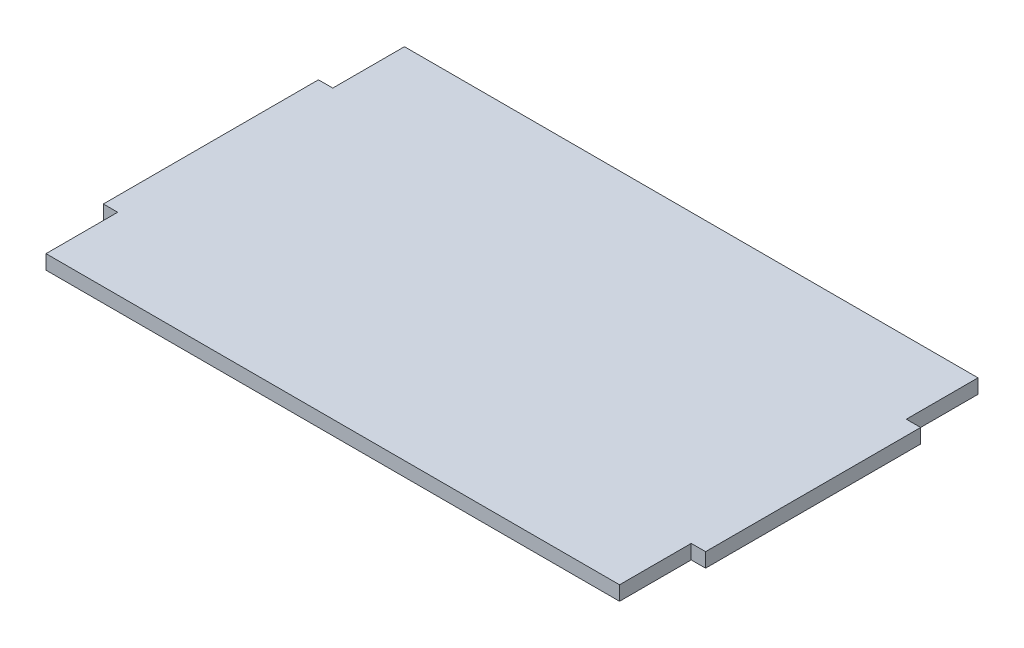
ISO-10303-21;
HEADER;
FILE_DESCRIPTION(('STEP AP214'),'2;1');
FILE_NAME('part.step','',(''),(''),'','','');
FILE_SCHEMA(('AUTOMOTIVE_DESIGN { 1 0 10303 214 1 1 1 1 }'));
ENDSEC;
DATA;
#1=APPLICATION_CONTEXT('core data for automotive mechanical design processes');
#2=APPLICATION_PROTOCOL_DEFINITION('international standard','automotive_design',2000,#1);
#3=PRODUCT_CONTEXT('',#1,'mechanical');
#4=PRODUCT('Part','Part','',(#3));
#5=PRODUCT_RELATED_PRODUCT_CATEGORY('part','',(#4));
#6=PRODUCT_DEFINITION_FORMATION('','',#4);
#7=PRODUCT_DEFINITION_CONTEXT('part definition',#1,'design');
#8=PRODUCT_DEFINITION('design','',#6,#7);
#9=PRODUCT_DEFINITION_SHAPE('','',#8);
#10=(LENGTH_UNIT() NAMED_UNIT(*) SI_UNIT(.MILLI.,.METRE.));
#11=(NAMED_UNIT(*) PLANE_ANGLE_UNIT() SI_UNIT($,.RADIAN.));
#12=(NAMED_UNIT(*) SI_UNIT($,.STERADIAN.) SOLID_ANGLE_UNIT());
#13=UNCERTAINTY_MEASURE_WITH_UNIT(LENGTH_MEASURE(1.E-05),#10,'distance_accuracy_value','');
#14=(GEOMETRIC_REPRESENTATION_CONTEXT(3) GLOBAL_UNCERTAINTY_ASSIGNED_CONTEXT((#13)) GLOBAL_UNIT_ASSIGNED_CONTEXT((#10,
#11,#12)) REPRESENTATION_CONTEXT('',''));
#15=CARTESIAN_POINT('',(0.,0.,0.));
#16=DIRECTION('',(0.,0.,1.));
#17=DIRECTION('',(1.,0.,0.));
#18=AXIS2_PLACEMENT_3D('',#15,#16,#17);
#19=CARTESIAN_POINT('',(0.,4.,0.));
#20=DIRECTION('',(1.,0.,0.));
#21=DIRECTION('',(0.,0.,-1.));
#22=AXIS2_PLACEMENT_3D('',#19,#20,#21);
#23=PLANE('',#22);
#24=DIRECTION('',(0.,0.,1.));
#25=VECTOR('',#24,1.);
#26=CARTESIAN_POINT('',(0.,0.,0.));
#27=LINE('',#26,#25);
#28=CARTESIAN_POINT('',(0.,0.,0.));
#29=VERTEX_POINT('',#28);
#30=CARTESIAN_POINT('',(0.,0.,20.));
#31=VERTEX_POINT('',#30);
#32=EDGE_CURVE('E172',#29,#31,#27,.T.);
#33=ORIENTED_EDGE('',*,*,#32,.T.);
#34=DIRECTION('',(0.,-1.,0.));
#35=VECTOR('',#34,1.);
#36=CARTESIAN_POINT('',(0.,4.,20.));
#37=LINE('',#36,#35);
#38=CARTESIAN_POINT('',(0.,4.,20.));
#39=VERTEX_POINT('',#38);
#40=EDGE_CURVE('E11',#39,#31,#37,.T.);
#41=ORIENTED_EDGE('',*,*,#40,.F.);
#42=DIRECTION('',(0.,0.,1.));
#43=VECTOR('',#42,1.);
#44=CARTESIAN_POINT('',(0.,4.,0.));
#45=LINE('',#44,#43);
#46=CARTESIAN_POINT('',(0.,4.,0.));
#47=VERTEX_POINT('',#46);
#48=EDGE_CURVE('E206',#47,#39,#45,.T.);
#49=ORIENTED_EDGE('',*,*,#48,.F.);
#50=DIRECTION('',(0.,-1.,0.));
#51=VECTOR('',#50,1.);
#52=CARTESIAN_POINT('',(0.,4.,0.));
#53=LINE('',#52,#51);
#54=EDGE_CURVE('E168',#47,#29,#53,.T.);
#55=ORIENTED_EDGE('',*,*,#54,.T.);
#56=EDGE_LOOP('',(#33,#41,#49,#55));
#57=FACE_BOUND('',#56,.T.);
#58=ADVANCED_FACE('F47',(#57),#23,.F.);
#59=CARTESIAN_POINT('',(0.,4.,20.));
#60=DIRECTION('',(0.,0.,1.));
#61=DIRECTION('',(1.,0.,0.));
#62=AXIS2_PLACEMENT_3D('',#59,#60,#61);
#63=PLANE('',#62);
#64=DIRECTION('',(-1.,0.,0.));
#65=VECTOR('',#64,1.);
#66=CARTESIAN_POINT('',(0.,0.,20.));
#67=LINE('',#66,#65);
#68=CARTESIAN_POINT('',(-4.,0.,20.));
#69=VERTEX_POINT('',#68);
#70=EDGE_CURVE('E176',#31,#69,#67,.T.);
#71=ORIENTED_EDGE('',*,*,#70,.T.);
#72=DIRECTION('',(0.,-1.,0.));
#73=VECTOR('',#72,1.);
#74=CARTESIAN_POINT('',(-4.,4.,20.));
#75=LINE('',#74,#73);
#76=CARTESIAN_POINT('',(-4.,4.,20.));
#77=VERTEX_POINT('',#76);
#78=EDGE_CURVE('E56',#77,#69,#75,.T.);
#79=ORIENTED_EDGE('',*,*,#78,.F.);
#80=DIRECTION('',(-1.,0.,0.));
#81=VECTOR('',#80,1.);
#82=CARTESIAN_POINT('',(0.,4.,20.));
#83=LINE('',#82,#81);
#84=EDGE_CURVE('E119',#39,#77,#83,.T.);
#85=ORIENTED_EDGE('',*,*,#84,.F.);
#86=ORIENTED_EDGE('',*,*,#40,.T.);
#87=EDGE_LOOP('',(#71,#79,#85,#86));
#88=FACE_BOUND('',#87,.T.);
#89=ADVANCED_FACE('F300',(#88),#63,.F.);
#90=CARTESIAN_POINT('',(-4.,4.,80.));
#91=DIRECTION('',(1.,0.,0.));
#92=DIRECTION('',(0.,0.,-1.));
#93=AXIS2_PLACEMENT_3D('',#90,#91,#92);
#94=PLANE('',#93);
#95=DIRECTION('',(0.,0.,1.));
#96=VECTOR('',#95,1.);
#97=CARTESIAN_POINT('',(-4.,0.,80.));
#98=LINE('',#97,#96);
#99=CARTESIAN_POINT('',(-4.,0.,80.));
#100=VERTEX_POINT('',#99);
#101=EDGE_CURVE('E179',#69,#100,#98,.T.);
#102=ORIENTED_EDGE('',*,*,#101,.T.);
#103=DIRECTION('',(0.,-1.,0.));
#104=VECTOR('',#103,1.);
#105=CARTESIAN_POINT('',(-4.,4.,80.));
#106=LINE('',#105,#104);
#107=CARTESIAN_POINT('',(-4.,4.,80.));
#108=VERTEX_POINT('',#107);
#109=EDGE_CURVE('E233',#108,#100,#106,.T.);
#110=ORIENTED_EDGE('',*,*,#109,.F.);
#111=DIRECTION('',(0.,0.,1.));
#112=VECTOR('',#111,1.);
#113=CARTESIAN_POINT('',(-4.,4.,80.));
#114=LINE('',#113,#112);
#115=EDGE_CURVE('E243',#77,#108,#114,.T.);
#116=ORIENTED_EDGE('',*,*,#115,.F.);
#117=ORIENTED_EDGE('',*,*,#78,.T.);
#118=EDGE_LOOP('',(#102,#110,#116,#117));
#119=FACE_BOUND('',#118,.T.);
#120=ADVANCED_FACE('F241',(#119),#94,.F.);
#121=CARTESIAN_POINT('',(0.,4.,80.));
#122=DIRECTION('',(0.,0.,-1.));
#123=DIRECTION('',(-1.,0.,0.));
#124=AXIS2_PLACEMENT_3D('',#121,#122,#123);
#125=PLANE('',#124);
#126=DIRECTION('',(1.,0.,0.));
#127=VECTOR('',#126,1.);
#128=CARTESIAN_POINT('',(0.,0.,80.));
#129=LINE('',#128,#127);
#130=CARTESIAN_POINT('',(0.,0.,80.));
#131=VERTEX_POINT('',#130);
#132=EDGE_CURVE('E182',#100,#131,#129,.T.);
#133=ORIENTED_EDGE('',*,*,#132,.T.);
#134=DIRECTION('',(0.,-1.,0.));
#135=VECTOR('',#134,1.);
#136=CARTESIAN_POINT('',(0.,4.,80.));
#137=LINE('',#136,#135);
#138=CARTESIAN_POINT('',(0.,4.,80.));
#139=VERTEX_POINT('',#138);
#140=EDGE_CURVE('E229',#139,#131,#137,.T.);
#141=ORIENTED_EDGE('',*,*,#140,.F.);
#142=DIRECTION('',(1.,0.,0.));
#143=VECTOR('',#142,1.);
#144=CARTESIAN_POINT('',(0.,4.,80.));
#145=LINE('',#144,#143);
#146=EDGE_CURVE('E262',#108,#139,#145,.T.);
#147=ORIENTED_EDGE('',*,*,#146,.F.);
#148=ORIENTED_EDGE('',*,*,#109,.T.);
#149=EDGE_LOOP('',(#133,#141,#147,#148));
#150=FACE_BOUND('',#149,.T.);
#151=ADVANCED_FACE('F252',(#150),#125,.F.);
#152=CARTESIAN_POINT('',(0.,4.,80.));
#153=DIRECTION('',(1.,0.,0.));
#154=DIRECTION('',(0.,0.,-1.));
#155=AXIS2_PLACEMENT_3D('',#152,#153,#154);
#156=PLANE('',#155);
#157=DIRECTION('',(0.,0.,1.));
#158=VECTOR('',#157,1.);
#159=CARTESIAN_POINT('',(0.,0.,80.));
#160=LINE('',#159,#158);
#161=CARTESIAN_POINT('',(0.,0.,100.));
#162=VERTEX_POINT('',#161);
#163=EDGE_CURVE('E185',#131,#162,#160,.T.);
#164=ORIENTED_EDGE('',*,*,#163,.T.);
#165=DIRECTION('',(0.,-1.,0.));
#166=VECTOR('',#165,1.);
#167=CARTESIAN_POINT('',(0.,4.,100.));
#168=LINE('',#167,#166);
#169=CARTESIAN_POINT('',(0.,4.,100.));
#170=VERTEX_POINT('',#169);
#171=EDGE_CURVE('E225',#170,#162,#168,.T.);
#172=ORIENTED_EDGE('',*,*,#171,.F.);
#173=DIRECTION('',(0.,0.,1.));
#174=VECTOR('',#173,1.);
#175=CARTESIAN_POINT('',(0.,4.,80.));
#176=LINE('',#175,#174);
#177=EDGE_CURVE('E258',#139,#170,#176,.T.);
#178=ORIENTED_EDGE('',*,*,#177,.F.);
#179=ORIENTED_EDGE('',*,*,#140,.T.);
#180=EDGE_LOOP('',(#164,#172,#178,#179));
#181=FACE_BOUND('',#180,.T.);
#182=ADVANCED_FACE('F256',(#181),#156,.F.);
#183=CARTESIAN_POINT('',(0.,4.,100.));
#184=DIRECTION('',(0.,0.,-1.));
#185=DIRECTION('',(-1.,0.,0.));
#186=AXIS2_PLACEMENT_3D('',#183,#184,#185);
#187=PLANE('',#186);
#188=DIRECTION('',(1.,0.,0.));
#189=VECTOR('',#188,1.);
#190=CARTESIAN_POINT('',(0.,0.,100.));
#191=LINE('',#190,#189);
#192=CARTESIAN_POINT('',(160.,0.,100.));
#193=VERTEX_POINT('',#192);
#194=EDGE_CURVE('E188',#162,#193,#191,.T.);
#195=ORIENTED_EDGE('',*,*,#194,.T.);
#196=DIRECTION('',(0.,-1.,0.));
#197=VECTOR('',#196,1.);
#198=CARTESIAN_POINT('',(160.,4.,100.));
#199=LINE('',#198,#197);
#200=CARTESIAN_POINT('',(160.,4.,100.));
#201=VERTEX_POINT('',#200);
#202=EDGE_CURVE('E221',#201,#193,#199,.T.);
#203=ORIENTED_EDGE('',*,*,#202,.F.);
#204=DIRECTION('',(1.,0.,0.));
#205=VECTOR('',#204,1.);
#206=CARTESIAN_POINT('',(0.,4.,100.));
#207=LINE('',#206,#205);
#208=EDGE_CURVE('E261',#170,#201,#207,.T.);
#209=ORIENTED_EDGE('',*,*,#208,.F.);
#210=ORIENTED_EDGE('',*,*,#171,.T.);
#211=EDGE_LOOP('',(#195,#203,#209,#210));
#212=FACE_BOUND('',#211,.T.);
#213=ADVANCED_FACE('F313',(#212),#187,.F.);
#214=CARTESIAN_POINT('',(160.,4.,80.));
#215=DIRECTION('',(-1.,0.,0.));
#216=DIRECTION('',(0.,0.,1.));
#217=AXIS2_PLACEMENT_3D('',#214,#215,#216);
#218=PLANE('',#217);
#219=DIRECTION('',(0.,0.,-1.));
#220=VECTOR('',#219,1.);
#221=CARTESIAN_POINT('',(160.,0.,80.));
#222=LINE('',#221,#220);
#223=CARTESIAN_POINT('',(160.,0.,80.));
#224=VERTEX_POINT('',#223);
#225=EDGE_CURVE('E191',#193,#224,#222,.T.);
#226=ORIENTED_EDGE('',*,*,#225,.T.);
#227=DIRECTION('',(0.,-1.,0.));
#228=VECTOR('',#227,1.);
#229=CARTESIAN_POINT('',(160.,4.,80.));
#230=LINE('',#229,#228);
#231=CARTESIAN_POINT('',(160.,4.,80.));
#232=VERTEX_POINT('',#231);
#233=EDGE_CURVE('E217',#232,#224,#230,.T.);
#234=ORIENTED_EDGE('',*,*,#233,.F.);
#235=DIRECTION('',(0.,0.,-1.));
#236=VECTOR('',#235,1.);
#237=CARTESIAN_POINT('',(160.,4.,80.));
#238=LINE('',#237,#236);
#239=EDGE_CURVE('E266',#201,#232,#238,.T.);
#240=ORIENTED_EDGE('',*,*,#239,.F.);
#241=ORIENTED_EDGE('',*,*,#202,.T.);
#242=EDGE_LOOP('',(#226,#234,#240,#241));
#243=FACE_BOUND('',#242,.T.);
#244=ADVANCED_FACE('F316',(#243),#218,.F.);
#245=CARTESIAN_POINT('',(160.,4.,80.));
#246=DIRECTION('',(0.,0.,-1.));
#247=DIRECTION('',(-1.,0.,0.));
#248=AXIS2_PLACEMENT_3D('',#245,#246,#247);
#249=PLANE('',#248);
#250=DIRECTION('',(1.,0.,0.));
#251=VECTOR('',#250,1.);
#252=CARTESIAN_POINT('',(160.,0.,80.));
#253=LINE('',#252,#251);
#254=CARTESIAN_POINT('',(164.,0.,80.));
#255=VERTEX_POINT('',#254);
#256=EDGE_CURVE('E194',#224,#255,#253,.T.);
#257=ORIENTED_EDGE('',*,*,#256,.T.);
#258=DIRECTION('',(0.,-1.,0.));
#259=VECTOR('',#258,1.);
#260=CARTESIAN_POINT('',(164.,4.,80.));
#261=LINE('',#260,#259);
#262=CARTESIAN_POINT('',(164.,4.,80.));
#263=VERTEX_POINT('',#262);
#264=EDGE_CURVE('E213',#263,#255,#261,.T.);
#265=ORIENTED_EDGE('',*,*,#264,.F.);
#266=DIRECTION('',(1.,0.,0.));
#267=VECTOR('',#266,1.);
#268=CARTESIAN_POINT('',(160.,4.,80.));
#269=LINE('',#268,#267);
#270=EDGE_CURVE('E273',#232,#263,#269,.T.);
#271=ORIENTED_EDGE('',*,*,#270,.F.);
#272=ORIENTED_EDGE('',*,*,#233,.T.);
#273=EDGE_LOOP('',(#257,#265,#271,#272));
#274=FACE_BOUND('',#273,.T.);
#275=ADVANCED_FACE('F281',(#274),#249,.F.);
#276=CARTESIAN_POINT('',(164.,4.,80.));
#277=DIRECTION('',(-1.,0.,0.));
#278=DIRECTION('',(0.,0.,1.));
#279=AXIS2_PLACEMENT_3D('',#276,#277,#278);
#280=PLANE('',#279);
#281=DIRECTION('',(0.,0.,-1.));
#282=VECTOR('',#281,1.);
#283=CARTESIAN_POINT('',(164.,0.,80.));
#284=LINE('',#283,#282);
#285=CARTESIAN_POINT('',(164.,0.,20.));
#286=VERTEX_POINT('',#285);
#287=EDGE_CURVE('E197',#255,#286,#284,.T.);
#288=ORIENTED_EDGE('',*,*,#287,.T.);
#289=DIRECTION('',(0.,-1.,0.));
#290=VECTOR('',#289,1.);
#291=CARTESIAN_POINT('',(164.,4.,20.));
#292=LINE('',#291,#290);
#293=CARTESIAN_POINT('',(164.,4.,20.));
#294=VERTEX_POINT('',#293);
#295=EDGE_CURVE('E161',#294,#286,#292,.T.);
#296=ORIENTED_EDGE('',*,*,#295,.F.);
#297=DIRECTION('',(0.,0.,-1.));
#298=VECTOR('',#297,1.);
#299=CARTESIAN_POINT('',(164.,4.,80.));
#300=LINE('',#299,#298);
#301=EDGE_CURVE('E150',#263,#294,#300,.T.);
#302=ORIENTED_EDGE('',*,*,#301,.F.);
#303=ORIENTED_EDGE('',*,*,#264,.T.);
#304=EDGE_LOOP('',(#288,#296,#302,#303));
#305=FACE_BOUND('',#304,.T.);
#306=ADVANCED_FACE('F285',(#305),#280,.F.);
#307=CARTESIAN_POINT('',(160.,4.,20.));
#308=DIRECTION('',(0.,0.,1.));
#309=DIRECTION('',(1.,0.,0.));
#310=AXIS2_PLACEMENT_3D('',#307,#308,#309);
#311=PLANE('',#310);
#312=DIRECTION('',(-1.,0.,0.));
#313=VECTOR('',#312,1.);
#314=CARTESIAN_POINT('',(160.,0.,20.));
#315=LINE('',#314,#313);
#316=CARTESIAN_POINT('',(160.,0.,20.));
#317=VERTEX_POINT('',#316);
#318=EDGE_CURVE('E159',#286,#317,#315,.T.);
#319=ORIENTED_EDGE('',*,*,#318,.T.);
#320=DIRECTION('',(0.,-1.,0.));
#321=VECTOR('',#320,1.);
#322=CARTESIAN_POINT('',(160.,4.,20.));
#323=LINE('',#322,#321);
#324=CARTESIAN_POINT('',(160.,4.,20.));
#325=VERTEX_POINT('',#324);
#326=EDGE_CURVE('E156',#325,#317,#323,.T.);
#327=ORIENTED_EDGE('',*,*,#326,.F.);
#328=DIRECTION('',(-1.,0.,0.));
#329=VECTOR('',#328,1.);
#330=CARTESIAN_POINT('',(160.,4.,20.));
#331=LINE('',#330,#329);
#332=EDGE_CURVE('E144',#294,#325,#331,.T.);
#333=ORIENTED_EDGE('',*,*,#332,.F.);
#334=ORIENTED_EDGE('',*,*,#295,.T.);
#335=EDGE_LOOP('',(#319,#327,#333,#334));
#336=FACE_BOUND('',#335,.T.);
#337=ADVANCED_FACE('F157',(#336),#311,.F.);
#338=CARTESIAN_POINT('',(160.,4.,0.));
#339=DIRECTION('',(-1.,0.,0.));
#340=DIRECTION('',(0.,0.,1.));
#341=AXIS2_PLACEMENT_3D('',#338,#339,#340);
#342=PLANE('',#341);
#343=DIRECTION('',(0.,0.,-1.));
#344=VECTOR('',#343,1.);
#345=CARTESIAN_POINT('',(160.,0.,0.));
#346=LINE('',#345,#344);
#347=CARTESIAN_POINT('',(160.,0.,0.));
#348=VERTEX_POINT('',#347);
#349=EDGE_CURVE('E105',#317,#348,#346,.T.);
#350=ORIENTED_EDGE('',*,*,#349,.T.);
#351=DIRECTION('',(0.,-1.,0.));
#352=VECTOR('',#351,1.);
#353=CARTESIAN_POINT('',(160.,4.,0.));
#354=LINE('',#353,#352);
#355=CARTESIAN_POINT('',(160.,4.,0.));
#356=VERTEX_POINT('',#355);
#357=EDGE_CURVE('E162',#356,#348,#354,.T.);
#358=ORIENTED_EDGE('',*,*,#357,.F.);
#359=DIRECTION('',(0.,0.,-1.));
#360=VECTOR('',#359,1.);
#361=CARTESIAN_POINT('',(160.,4.,0.));
#362=LINE('',#361,#360);
#363=EDGE_CURVE('E148',#325,#356,#362,.T.);
#364=ORIENTED_EDGE('',*,*,#363,.F.);
#365=ORIENTED_EDGE('',*,*,#326,.T.);
#366=EDGE_LOOP('',(#350,#358,#364,#365));
#367=FACE_BOUND('',#366,.T.);
#368=ADVANCED_FACE('F164',(#367),#342,.F.);
#369=CARTESIAN_POINT('',(0.,4.,0.));
#370=DIRECTION('',(0.,0.,1.));
#371=DIRECTION('',(1.,0.,0.));
#372=AXIS2_PLACEMENT_3D('',#369,#370,#371);
#373=PLANE('',#372);
#374=DIRECTION('',(-1.,0.,0.));
#375=VECTOR('',#374,1.);
#376=CARTESIAN_POINT('',(0.,0.,0.));
#377=LINE('',#376,#375);
#378=EDGE_CURVE('E111',#348,#29,#377,.T.);
#379=ORIENTED_EDGE('',*,*,#378,.T.);
#380=ORIENTED_EDGE('',*,*,#54,.F.);
#381=DIRECTION('',(-1.,0.,0.));
#382=VECTOR('',#381,1.);
#383=CARTESIAN_POINT('',(0.,4.,0.));
#384=LINE('',#383,#382);
#385=EDGE_CURVE('E64',#356,#47,#384,.T.);
#386=ORIENTED_EDGE('',*,*,#385,.F.);
#387=ORIENTED_EDGE('',*,*,#357,.T.);
#388=EDGE_LOOP('',(#379,#380,#386,#387));
#389=FACE_BOUND('',#388,.T.);
#390=ADVANCED_FACE('F289',(#389),#373,.F.);
#391=CARTESIAN_POINT('',(0.,4.,0.));
#392=DIRECTION('',(0.,-1.,0.));
#393=DIRECTION('',(0.,0.,-1.));
#394=AXIS2_PLACEMENT_3D('',#391,#392,#393);
#395=PLANE('',#394);
#396=ORIENTED_EDGE('',*,*,#48,.T.);
#397=ORIENTED_EDGE('',*,*,#84,.T.);
#398=ORIENTED_EDGE('',*,*,#115,.T.);
#399=ORIENTED_EDGE('',*,*,#146,.T.);
#400=ORIENTED_EDGE('',*,*,#177,.T.);
#401=ORIENTED_EDGE('',*,*,#208,.T.);
#402=ORIENTED_EDGE('',*,*,#239,.T.);
#403=ORIENTED_EDGE('',*,*,#270,.T.);
#404=ORIENTED_EDGE('',*,*,#301,.T.);
#405=ORIENTED_EDGE('',*,*,#332,.T.);
#406=ORIENTED_EDGE('',*,*,#363,.T.);
#407=ORIENTED_EDGE('',*,*,#385,.T.);
#408=EDGE_LOOP('',(#396,#397,#398,#399,#400,#401,#402,#403,#404,#405,#406,#407));
#409=FACE_BOUND('',#408,.T.);
#410=ADVANCED_FACE('F146',(#409),#395,.F.);
#411=CARTESIAN_POINT('',(0.,0.,0.));
#412=DIRECTION('',(0.,-1.,0.));
#413=DIRECTION('',(0.,0.,-1.));
#414=AXIS2_PLACEMENT_3D('',#411,#412,#413);
#415=PLANE('',#414);
#416=ORIENTED_EDGE('',*,*,#32,.F.);
#417=ORIENTED_EDGE('',*,*,#378,.F.);
#418=ORIENTED_EDGE('',*,*,#349,.F.);
#419=ORIENTED_EDGE('',*,*,#318,.F.);
#420=ORIENTED_EDGE('',*,*,#287,.F.);
#421=ORIENTED_EDGE('',*,*,#256,.F.);
#422=ORIENTED_EDGE('',*,*,#225,.F.);
#423=ORIENTED_EDGE('',*,*,#194,.F.);
#424=ORIENTED_EDGE('',*,*,#163,.F.);
#425=ORIENTED_EDGE('',*,*,#132,.F.);
#426=ORIENTED_EDGE('',*,*,#101,.F.);
#427=ORIENTED_EDGE('',*,*,#70,.F.);
#428=EDGE_LOOP('',(#416,#417,#418,#419,#420,#421,#422,#423,#424,#425,#426,#427));
#429=FACE_BOUND('',#428,.T.);
#430=ADVANCED_FACE('F247',(#429),#415,.T.);
#431=CLOSED_SHELL('',(#58,#89,#120,#151,#182,#213,#244,#275,#306,#337,#368,#390,#410,#430));
#432=MANIFOLD_SOLID_BREP('B2',#431);
#433=ADVANCED_BREP_SHAPE_REPRESENTATION('',(#18,#432),#14);
#434=SHAPE_DEFINITION_REPRESENTATION(#9,#433);
ENDSEC;
END-ISO-10303-21;
